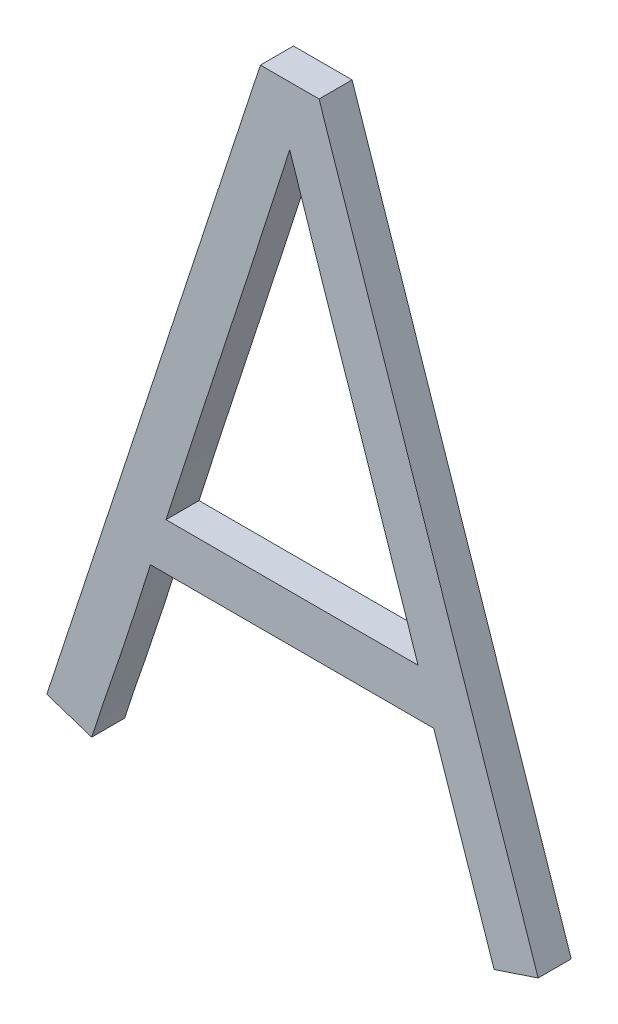
ISO-10303-21;
HEADER;
FILE_DESCRIPTION(('STEP AP214'),'2;1');
FILE_NAME('part.step','',(''),(''),'','','');
FILE_SCHEMA(('AUTOMOTIVE_DESIGN { 1 0 10303 214 1 1 1 1 }'));
ENDSEC;
DATA;
#1=APPLICATION_CONTEXT('core data for automotive mechanical design processes');
#2=APPLICATION_PROTOCOL_DEFINITION('international standard','automotive_design',2000,#1);
#3=PRODUCT_CONTEXT('',#1,'mechanical');
#4=PRODUCT('Part','Part','',(#3));
#5=PRODUCT_RELATED_PRODUCT_CATEGORY('part','',(#4));
#6=PRODUCT_DEFINITION_FORMATION('','',#4);
#7=PRODUCT_DEFINITION_CONTEXT('part definition',#1,'design');
#8=PRODUCT_DEFINITION('design','',#6,#7);
#9=PRODUCT_DEFINITION_SHAPE('','',#8);
#10=(LENGTH_UNIT() NAMED_UNIT(*) SI_UNIT(.MILLI.,.METRE.));
#11=(NAMED_UNIT(*) PLANE_ANGLE_UNIT() SI_UNIT($,.RADIAN.));
#12=(NAMED_UNIT(*) SI_UNIT($,.STERADIAN.) SOLID_ANGLE_UNIT());
#13=UNCERTAINTY_MEASURE_WITH_UNIT(LENGTH_MEASURE(1.E-05),#10,'distance_accuracy_value','');
#14=(GEOMETRIC_REPRESENTATION_CONTEXT(3) GLOBAL_UNCERTAINTY_ASSIGNED_CONTEXT((#13)) GLOBAL_UNIT_ASSIGNED_CONTEXT((#10,
#11,#12)) REPRESENTATION_CONTEXT('',''));
#15=CARTESIAN_POINT('',(0.,0.,0.));
#16=DIRECTION('',(0.,0.,1.));
#17=DIRECTION('',(1.,0.,0.));
#18=AXIS2_PLACEMENT_3D('',#15,#16,#17);
#19=CARTESIAN_POINT('',(63.3244439474191,66.035169325091,-39.1));
#20=DIRECTION('',(0.,9.63997862651713E-12,1.));
#21=DIRECTION('',(0.,-1.,9.63997862651713E-12));
#22=AXIS2_PLACEMENT_3D('',#19,#20,#21);
#23=PLANE('',#22);
#24=DIRECTION('',(1.,0.,0.));
#25=VECTOR('',#24,1.);
#26=CARTESIAN_POINT('',(64.2213908698903,66.4476931722211,-39.1));
#27=LINE('',#26,#25);
#28=CARTESIAN_POINT('',(63.4585614662903,66.4476931722211,-39.099999999999));
#29=VERTEX_POINT('',#28);
#30=CARTESIAN_POINT('',(64.2213908698903,66.4476931722211,-39.099999999999));
#31=VERTEX_POINT('',#30);
#32=EDGE_CURVE('E121',#29,#31,#27,.T.);
#33=ORIENTED_EDGE('',*,*,#32,.T.);
#34=CARTESIAN_POINT('',(64.2213908698903,66.4476931722211,-39.099999999998));
#35=CARTESIAN_POINT('',(64.2108516174786,66.4793164753443,-39.0999999999969));
#36=CARTESIAN_POINT('',(64.2003009751093,66.5109359833296,-39.1000000000004));
#37=CARTESIAN_POINT('',(64.1791809493051,66.5741688182707,-39.1000000000094));
#38=CARTESIAN_POINT('',(64.1686115658287,66.6057821452125,-39.1000000000148));
#39=CARTESIAN_POINT('',(64.1368814150085,66.7006148095122,-39.1000000000226));
#40=CARTESIAN_POINT('',(64.1156986646282,66.7638267783165,-39.1000000000166));
#41=CARTESIAN_POINT('',(64.0732392328759,66.8902192203776,-39.0999999999986));
#42=CARTESIAN_POINT('',(64.0519625516351,66.9533996936783,-39.0999999999867));
#43=CARTESIAN_POINT('',(64.0139639450191,67.0654816477114,-39.0999999999936));
#44=CARTESIAN_POINT('',(63.9972932267702,67.114400504903,-39.1000000000061));
#45=CARTESIAN_POINT('',(63.9639347721806,67.2122322983695,-39.1000000000156));
#46=CARTESIAN_POINT('',(63.9472470359161,67.2611452346699,-39.1000000000126));
#47=CARTESIAN_POINT('',(63.9224651223619,67.3345993274547,-39.1000000000121));
#48=CARTESIAN_POINT('',(63.9142460710539,67.3590982264771,-39.1000000000127));
#49=CARTESIAN_POINT('',(63.8978980794248,67.408126165136,-39.1000000000133));
#50=CARTESIAN_POINT('',(63.8897691395381,67.4326552049172,-39.1000000000135));
#51=CARTESIAN_POINT('',(63.8735647601332,67.4817316759786,-39.1000000000139));
#52=CARTESIAN_POINT('',(63.8654893221128,67.5062791077524,-39.1000000000142));
#53=CARTESIAN_POINT('',(63.8493086235244,67.5553639144615,-39.1000000000147));
#54=CARTESIAN_POINT('',(63.8412033631839,67.5799012894718,-39.1000000000149));
#55=CARTESIAN_POINT('',(63.8330413552903,67.6044199406011,-39.1000000000152));
#56=B_SPLINE_CURVE_WITH_KNOTS('',3,(#34,#35,#36,#37,#38,#39,#40,#41,#42,#43,#44,#45,#46,#47,#48,
#49,#50,#51,#52,#53,#54,#55),.UNSPECIFIED.,.F.,.F.,(4,2,2,2,2,2,2,2,2,2,4),(0.,
0.099999912467656,0.200000047218201,0.400000481257188,0.600000635929237,0.755044814762776,
0.91008830123574,0.987610592252216,1.06513325678089,1.14265808242463,1.22018231804583),.UNSPECIFIED.);
#57=CARTESIAN_POINT('',(63.8330413552903,67.6044199406011,-39.1000000000151));
#58=VERTEX_POINT('',#57);
#59=EDGE_CURVE('E168',#31,#58,#56,.T.);
#60=ORIENTED_EDGE('',*,*,#59,.T.);
#61=CARTESIAN_POINT('',(63.8330413552903,67.6044199406011,-39.1000000000151));
#62=CARTESIAN_POINT('',(63.8278205731385,67.5885910271764,-39.100000000015));
#63=CARTESIAN_POINT('',(63.8226726849173,67.5727385397149,-39.1000000000148));
#64=CARTESIAN_POINT('',(63.8124571177524,67.5410078162966,-39.1000000000145));
#65=CARTESIAN_POINT('',(63.807389438188,67.5251295805401,-39.1000000000143));
#66=CARTESIAN_POINT('',(63.7922081977502,67.4774878884502,-39.100000000014));
#67=CARTESIAN_POINT('',(63.782116464866,67.4457175400197,-39.1000000000141));
#68=CARTESIAN_POINT('',(63.7517099440857,67.3504503953441,-39.1000000000117));
#69=CARTESIAN_POINT('',(63.7312632518136,67.286995639971,-39.1000000000068));
#70=CARTESIAN_POINT('',(63.6901830321792,67.1601470114942,-39.1000000000161));
#71=CARTESIAN_POINT('',(63.6695495051064,67.0967531382964,-39.1000000000304));
#72=CARTESIAN_POINT('',(63.6329239084584,66.9845959165781,-39.1000000000276));
#73=CARTESIAN_POINT('',(63.6169569171012,66.9358243785731,-39.1000000000169));
#74=CARTESIAN_POINT('',(63.5849754369602,66.8382968546229,-39.0999999999995));
#75=CARTESIAN_POINT('',(63.5689609481743,66.7895408686782,-39.0999999999927));
#76=CARTESIAN_POINT('',(63.5371070081971,66.6919715361894,-39.0999999999936));
#77=CARTESIAN_POINT('',(63.5212675573466,66.6431581895337,-39.1000000000013));
#78=CARTESIAN_POINT('',(63.4897734180133,66.5454712830568,-39.1000000000095));
#79=CARTESIAN_POINT('',(63.4741187317694,66.4965977225138,-39.10000000001));
#80=CARTESIAN_POINT('',(63.4585614662903,66.4476931722211,-39.099999999996));
#81=B_SPLINE_CURVE_WITH_KNOTS('',3,(#61,#62,#63,#64,#65,#66,#67,#68,#69,#70,#71,#72,#73,#74,#75,
#76,#77,#78,#79,#80),.UNSPECIFIED.,.F.,.F.,(4,2,2,2,2,2,2,2,2,4),(0.,0.0500022170825777,
0.100004047009198,0.200007998982023,0.400010056723153,0.600011804566333,0.753967838289627,
0.907923878196058,1.06188021787056,1.21583842124076),.UNSPECIFIED.);
#82=EDGE_CURVE('E129',#58,#29,#81,.T.);
#83=ORIENTED_EDGE('',*,*,#82,.T.);
#84=EDGE_LOOP('',(#33,#60,#83));
#85=FACE_BOUND('',#84,.T.);
#86=DIRECTION('',(0.311412180161719,0.950274936030055,0.));
#87=VECTOR('',#86,1.);
#88=CARTESIAN_POINT('',(63.7442757519336,67.7819511472697,-39.1));
#89=LINE('',#88,#87);
#90=CARTESIAN_POINT('',(63.0979512026919,65.8096903982959,-39.1));
#91=VERTEX_POINT('',#90);
#92=CARTESIAN_POINT('',(63.7442757519761,67.7819511472557,-39.1000000000042));
#93=VERTEX_POINT('',#92);
#94=EDGE_CURVE('E110',#91,#93,#89,.T.);
#95=ORIENTED_EDGE('',*,*,#94,.T.);
#96=DIRECTION('',(1.,0.,0.));
#97=VECTOR('',#96,1.);
#98=CARTESIAN_POINT('',(63.9218069585903,67.7819511472511,-39.1));
#99=LINE('',#98,#97);
#100=CARTESIAN_POINT('',(63.9218069585903,67.7819511472511,-39.1000000000042));
#101=VERTEX_POINT('',#100);
#102=EDGE_CURVE('E214',#93,#101,#99,.T.);
#103=ORIENTED_EDGE('',*,*,#102,.T.);
#104=DIRECTION('',(0.318626451465812,-0.947880363983928,0.));
#105=VECTOR('',#104,1.);
#106=CARTESIAN_POINT('',(64.5847750584557,65.8096903982795,-39.1));
#107=LINE('',#106,#105);
#108=CARTESIAN_POINT('',(64.5847750584557,65.8096903982796,-39.0999999999995));
#109=VERTEX_POINT('',#108);
#110=EDGE_CURVE('E220',#101,#109,#107,.T.);
#111=ORIENTED_EDGE('',*,*,#110,.T.);
#112=DIRECTION('',(-0.948683298050467,-0.316227766016979,0.));
#113=VECTOR('',#112,1.);
#114=CARTESIAN_POINT('',(64.4516266534923,65.7653075966251,-39.1));
#115=LINE('',#114,#113);
#116=CARTESIAN_POINT('',(64.4516266534908,65.7653075966296,-39.0999999999994));
#117=VERTEX_POINT('',#116);
#118=EDGE_CURVE('E226',#109,#117,#115,.T.);
#119=ORIENTED_EDGE('',*,*,#118,.T.);
#120=DIRECTION('',(-0.320596174316895,0.947215969572605,0.));
#121=VECTOR('',#120,1.);
#122=CARTESIAN_POINT('',(64.2685475966226,66.3062229919221,-39.1));
#123=LINE('',#122,#121);
#124=CARTESIAN_POINT('',(64.2685475966172,66.3062229919184,-39.1));
#125=VERTEX_POINT('',#124);
#126=EDGE_CURVE('E136',#117,#125,#123,.T.);
#127=ORIENTED_EDGE('',*,*,#126,.T.);
#128=DIRECTION('',(1.,0.,0.));
#129=VECTOR('',#128,1.);
#130=CARTESIAN_POINT('',(63.4114047394903,66.3062229919111,-39.1));
#131=LINE('',#130,#129);
#132=CARTESIAN_POINT('',(63.4114047394903,66.3062229919111,-39.0999999999993));
#133=VERTEX_POINT('',#132);
#134=EDGE_CURVE('E97',#125,#133,#131,.F.);
#135=ORIENTED_EDGE('',*,*,#134,.T.);
#136=CARTESIAN_POINT('',(63.4114047394903,66.3062229919111,-39.0999999999987));
#137=CARTESIAN_POINT('',(63.4015553913232,66.2743755498937,-39.1000000000022));
#138=CARTESIAN_POINT('',(63.3916029509865,66.2425596810493,-39.1000000000024));
#139=CARTESIAN_POINT('',(63.3714608418643,66.1790062694262,-39.100000000001));
#140=CARTESIAN_POINT('',(63.3612711941593,66.1472687199624,-39.0999999999993));
#141=CARTESIAN_POINT('',(63.3414138721604,66.0863126232057,-39.0999999999991));
#142=CARTESIAN_POINT('',(63.3317661149436,66.0570875947001,-39.1000000000003));
#143=CARTESIAN_POINT('',(63.3171446191014,66.0132998822177,-39.0999999999998));
#144=CARTESIAN_POINT('',(63.3122457363777,65.9987120661247,-39.0999999999992));
#145=CARTESIAN_POINT('',(63.3024052825693,65.96955064212,-39.0999999999998));
#146=CARTESIAN_POINT('',(63.2974637115348,65.9549770341915,-39.1000000000011));
#147=CARTESIAN_POINT('',(63.2874400989424,65.9258772389223,-39.1000000000008));
#148=CARTESIAN_POINT('',(63.2823580475636,65.9113510549766,-39.0999999999993));
#149=CARTESIAN_POINT('',(63.272223962651,65.8822884698045,-39.0999999999981));
#150=CARTESIAN_POINT('',(63.2671719280633,65.867752068957,-39.0999999999984));
#151=CARTESIAN_POINT('',(63.2573104026218,65.8385986642462,-39.0999999999981));
#152=CARTESIAN_POINT('',(63.252500886413,65.823981668987,-39.0999999999975));
#153=CARTESIAN_POINT('',(63.2430644871906,65.7946850751376,-39.0999999999981));
#154=CARTESIAN_POINT('',(63.2384376455426,65.7800054631928,-39.0999999999993));
#155=CARTESIAN_POINT('',(63.2338735327903,65.7653075966311,-39.1000000000026));
#156=B_SPLINE_CURVE_WITH_KNOTS('',3,(#136,#137,#138,#139,#140,#141,#142,#143,#144,#145,#146,
#147,#148,#149,#150,#151,#152,#153,#154,#155),.UNSPECIFIED.,.F.,.F.,(4,2,2,2,2,2,2,2,2,4),(0.,
0.100007393144787,0.200005932407737,0.292333828696262,0.338499152530509,0.384664422056366,
0.430832927139567,0.476999801604948,0.523161839305254,0.569334270857004),.UNSPECIFIED.);
#157=CARTESIAN_POINT('',(63.2338735327903,65.7653075966311,-39.1000000000006));
#158=VERTEX_POINT('',#157);
#159=EDGE_CURVE('E24',#133,#158,#156,.T.);
#160=ORIENTED_EDGE('',*,*,#159,.T.);
#161=DIRECTION('',(-0.950605456490971,0.310401781711369,0.));
#162=VECTOR('',#161,1.);
#163=CARTESIAN_POINT('',(63.0979512026919,65.8096903982959,-39.1));
#164=LINE('',#163,#162);
#165=EDGE_CURVE('E85',#158,#91,#164,.T.);
#166=ORIENTED_EDGE('',*,*,#165,.T.);
#167=EDGE_LOOP('',(#95,#103,#111,#119,#127,#135,#160,#166));
#168=FACE_BOUND('',#167,.T.);
#169=ADVANCED_FACE('F17',(#85,#168),#23,.F.);
#170=CARTESIAN_POINT('',(63.0979512026919,65.8096903982959,-39.));
#171=DIRECTION('',(0.310401781711369,0.950605456490971,0.));
#172=DIRECTION('',(-0.950605456490971,0.310401781711369,0.));
#173=AXIS2_PLACEMENT_3D('',#170,#171,#172);
#174=PLANE('',#173);
#175=DIRECTION('',(0.,0.,1.));
#176=VECTOR('',#175,1.);
#177=CARTESIAN_POINT('',(63.2338735327903,65.7653075966311,-39.05));
#178=LINE('',#177,#176);
#179=CARTESIAN_POINT('',(63.2338735327903,65.7653075966311,-38.9999999999993));
#180=VERTEX_POINT('',#179);
#181=EDGE_CURVE('E88',#158,#180,#178,.T.);
#182=ORIENTED_EDGE('',*,*,#181,.T.);
#183=DIRECTION('',(0.95060545649095,-0.310401781711434,3.00878689279397E-12));
#184=VECTOR('',#183,1.);
#185=CARTESIAN_POINT('',(63.0979512026919,65.8096903982959,-38.9999999999978));
#186=LINE('',#185,#184);
#187=CARTESIAN_POINT('',(63.0979512026919,65.8096903982959,-38.9999999999978));
#188=VERTEX_POINT('',#187);
#189=EDGE_CURVE('E123',#188,#180,#186,.T.);
#190=ORIENTED_EDGE('',*,*,#189,.F.);
#191=DIRECTION('',(0.,0.,1.));
#192=VECTOR('',#191,1.);
#193=CARTESIAN_POINT('',(63.0979512026919,65.8096903982959,-39.));
#194=LINE('',#193,#192);
#195=EDGE_CURVE('E91',#188,#91,#194,.F.);
#196=ORIENTED_EDGE('',*,*,#195,.T.);
#197=ORIENTED_EDGE('',*,*,#165,.F.);
#198=EDGE_LOOP('',(#182,#190,#196,#197));
#199=FACE_BOUND('',#198,.T.);
#200=ADVANCED_FACE('F86',(#199),#174,.F.);
#201=CARTESIAN_POINT('',(63.2338735327903,65.7653075966311,-39.));
#202=CARTESIAN_POINT('',(63.2338735327903,65.7653075966311,-39.1));
#203=CARTESIAN_POINT('',(63.2390076233903,65.7818808776511,-39.));
#204=CARTESIAN_POINT('',(63.2390076233903,65.7818808776511,-39.1));
#205=CARTESIAN_POINT('',(63.2498254780903,65.8160820286211,-39.));
#206=CARTESIAN_POINT('',(63.2498254780903,65.8160820286211,-39.1));
#207=CARTESIAN_POINT('',(63.2673700837903,65.8688013646211,-39.));
#208=CARTESIAN_POINT('',(63.2673700837903,65.8688013646211,-39.1));
#209=CARTESIAN_POINT('',(63.2860970132903,65.9217129883511,-39.));
#210=CARTESIAN_POINT('',(63.2860970132903,65.9217129883511,-39.1));
#211=CARTESIAN_POINT('',(63.3046497146903,65.9760772357511,-39.));
#212=CARTESIAN_POINT('',(63.3046497146903,65.9760772357511,-39.1));
#213=CARTESIAN_POINT('',(63.3235981478903,66.0324833115611,-39.));
#214=CARTESIAN_POINT('',(63.3235981478903,66.0324833115611,-39.1));
#215=CARTESIAN_POINT('',(63.3440276705903,66.0942177760611,-39.));
#216=CARTESIAN_POINT('',(63.3440276705903,66.0942177760611,-39.1));
#217=CARTESIAN_POINT('',(63.3656944088903,66.1608828712111,-39.));
#218=CARTESIAN_POINT('',(63.3656944088903,66.1608828712111,-39.1));
#219=CARTESIAN_POINT('',(63.3883327100903,66.2320864682411,-39.));
#220=CARTESIAN_POINT('',(63.3883327100903,66.2320864682411,-39.1));
#221=CARTESIAN_POINT('',(63.4036030780903,66.2810343335811,-39.));
#222=CARTESIAN_POINT('',(63.4036030780903,66.2810343335811,-39.1));
#223=CARTESIAN_POINT('',(63.4114047394903,66.3062229919111,-39.));
#224=CARTESIAN_POINT('',(63.4114047394903,66.3062229919111,-39.1));
#225=B_SPLINE_SURFACE_WITH_KNOTS('',3,1,((#201,#202),(#203,#204),(#205,#206),(#207,#208),(#209,
#210),(#211,#212),(#213,#214),(#215,#216),(#217,#218),(#219,#220),(#221,#222),(#223,#224)),
.UNSPECIFIED.,.F.,.F.,.F.,(4,1,1,1,1,1,1,1,1,4),(2,2),(0.,0.0914270828581,0.1890068395642,
0.29275856775,0.3871744050524,0.4916877757263,0.6063014793816,0.7298204969688,0.8610519020711,
1.),(1.,1.1),.UNSPECIFIED.);
#226=DIRECTION('',(0.,0.,1.));
#227=VECTOR('',#226,1.);
#228=CARTESIAN_POINT('',(63.4114047394903,66.3062229919111,-39.));
#229=LINE('',#228,#227);
#230=CARTESIAN_POINT('',(63.4114047394903,66.3062229919111,-39.0000000000026));
#231=VERTEX_POINT('',#230);
#232=EDGE_CURVE('E99',#133,#231,#229,.T.);
#233=CARTESIAN_POINT('',(63.2338735327903,65.7653075966311,-39.0000000000013));
#234=CARTESIAN_POINT('',(63.2388173735855,65.7812307323006,-38.9999999999989));
#235=CARTESIAN_POINT('',(63.2438372687456,65.7971318409421,-38.9999999999981));
#236=CARTESIAN_POINT('',(63.2540944696768,65.8288598670642,-38.9999999999977));
#237=CARTESIAN_POINT('',(63.2593317289056,65.844686799628,-38.9999999999981));
#238=CARTESIAN_POINT('',(63.2700915776101,65.8762448092172,-38.9999999999985));
#239=CARTESIAN_POINT('',(63.2756141971515,65.8919758759461,-38.9999999999984));
#240=CARTESIAN_POINT('',(63.286591443107,65.9234618589669,-38.9999999999991));
#241=CARTESIAN_POINT('',(63.292046067727,65.9392167758759,-38.9999999999999));
#242=CARTESIAN_POINT('',(63.3024144800101,65.9695507503083,-39.0000000000001));
#243=CARTESIAN_POINT('',(63.3073375012369,65.984126644201,-38.9999999999997));
#244=CARTESIAN_POINT('',(63.3171412220428,66.01329264354,-38.9999999999996));
#245=CARTESIAN_POINT('',(63.3220219213492,66.0278827490772,-38.9999999999999));
#246=CARTESIAN_POINT('',(63.3365889059155,66.0716771457789,-39.0000000000003));
#247=CARTESIAN_POINT('',(63.3462003905806,66.1009064362849,-38.9999999999998));
#248=CARTESIAN_POINT('',(63.3651902151827,66.1594469005944,-39.0000000000002));
#249=CARTESIAN_POINT('',(63.3745685090006,66.1887580893401,-39.0000000000013));
#250=CARTESIAN_POINT('',(63.3931266457987,66.2474455383943,-39.0000000000022));
#251=CARTESIAN_POINT('',(63.4023064747632,66.276821803138,-39.0000000000021));
#252=CARTESIAN_POINT('',(63.4114047394903,66.3062229919111,-39.));
#253=B_SPLINE_CURVE_WITH_KNOTS('',3,(#233,#234,#235,#236,#237,#238,#239,#240,#241,#242,#243,
#244,#245,#246,#247,#248,#249,#250,#251,#252),.UNSPECIFIED.,.F.,.F.,(4,2,2,2,2,2,2,2,2,4),(0.,
0.0500212573007998,0.100031858692739,0.150047740013242,0.200064938362839,0.24621909070013,
0.292373540041359,0.384679525765221,0.477003624286526,0.569334221684642),.UNSPECIFIED.);
#254=EDGE_CURVE('E102',#180,#231,#253,.T.);
#255=ORIENTED_EDGE('',*,*,#232,.T.);
#256=ORIENTED_EDGE('',*,*,#254,.F.);
#257=ORIENTED_EDGE('',*,*,#181,.F.);
#258=ORIENTED_EDGE('',*,*,#159,.F.);
#259=EDGE_LOOP('',(#255,#256,#257,#258));
#260=FACE_BOUND('',#259,.T.);
#261=ADVANCED_FACE('F100',(#260),#225,.F.);
#262=CARTESIAN_POINT('',(63.4114047394903,66.3062229919111,-39.));
#263=DIRECTION('',(0.,1.,0.));
#264=DIRECTION('',(0.,0.,1.));
#265=AXIS2_PLACEMENT_3D('',#262,#263,#264);
#266=PLANE('',#265);
#267=DIRECTION('',(0.,0.,1.));
#268=VECTOR('',#267,1.);
#269=CARTESIAN_POINT('',(64.2685475966226,66.306222991922,-39.));
#270=LINE('',#269,#268);
#271=CARTESIAN_POINT('',(64.2685475966011,66.3062229919148,-39.0000000000026));
#272=VERTEX_POINT('',#271);
#273=EDGE_CURVE('E133',#125,#272,#270,.T.);
#274=ORIENTED_EDGE('',*,*,#273,.T.);
#275=DIRECTION('',(1.,0.,0.));
#276=VECTOR('',#275,1.);
#277=CARTESIAN_POINT('',(63.3244439474191,66.3062229919111,-39.0000000000026));
#278=LINE('',#277,#276);
#279=EDGE_CURVE('E167',#231,#272,#278,.T.);
#280=ORIENTED_EDGE('',*,*,#279,.F.);
#281=ORIENTED_EDGE('',*,*,#232,.F.);
#282=ORIENTED_EDGE('',*,*,#134,.F.);
#283=EDGE_LOOP('',(#274,#280,#281,#282));
#284=FACE_BOUND('',#283,.T.);
#285=ADVANCED_FACE('F177',(#284),#266,.F.);
#286=CARTESIAN_POINT('',(64.2685475966226,66.3062229919221,-39.));
#287=DIRECTION('',(0.947215969572605,0.320596174316895,0.));
#288=DIRECTION('',(-0.320596174316895,0.947215969572605,0.));
#289=AXIS2_PLACEMENT_3D('',#286,#287,#288);
#290=PLANE('',#289);
#291=DIRECTION('',(0.,0.,1.));
#292=VECTOR('',#291,1.);
#293=CARTESIAN_POINT('',(64.4516266534923,65.7653075966251,-39.));
#294=LINE('',#293,#292);
#295=CARTESIAN_POINT('',(64.4516266534908,65.7653075966296,-38.9999999999994));
#296=VERTEX_POINT('',#295);
#297=EDGE_CURVE('E138',#117,#296,#294,.T.);
#298=ORIENTED_EDGE('',*,*,#297,.T.);
#299=DIRECTION('',(0.320596174373443,-0.947215969553466,9.13750771927774E-12));
#300=VECTOR('',#299,1.);
#301=CARTESIAN_POINT('',(64.2685475965903,66.3062229919111,-39.0000000000026));
#302=LINE('',#301,#300);
#303=EDGE_CURVE('E232',#272,#296,#302,.T.);
#304=ORIENTED_EDGE('',*,*,#303,.F.);
#305=ORIENTED_EDGE('',*,*,#273,.F.);
#306=ORIENTED_EDGE('',*,*,#126,.F.);
#307=EDGE_LOOP('',(#298,#304,#305,#306));
#308=FACE_BOUND('',#307,.T.);
#309=ADVANCED_FACE('F247',(#308),#290,.F.);
#310=CARTESIAN_POINT('',(64.4516266534923,65.7653075966251,-39.));
#311=DIRECTION('',(-0.316227766016979,0.948683298050467,0.));
#312=DIRECTION('',(-0.948683298050467,-0.316227766016979,0.));
#313=AXIS2_PLACEMENT_3D('',#310,#311,#312);
#314=PLANE('',#313);
#315=DIRECTION('',(0.,0.,1.));
#316=VECTOR('',#315,1.);
#317=CARTESIAN_POINT('',(64.5847750584557,65.8096903982796,-39.));
#318=LINE('',#317,#316);
#319=CARTESIAN_POINT('',(64.5847750584557,65.8096903982796,-38.9999999999995));
#320=VERTEX_POINT('',#319);
#321=EDGE_CURVE('E223',#109,#320,#318,.T.);
#322=ORIENTED_EDGE('',*,*,#321,.T.);
#323=DIRECTION('',(0.948683298064703,0.31622776597427,-3.06525933100154E-12));
#324=VECTOR('',#323,1.);
#325=CARTESIAN_POINT('',(64.4516266534903,65.7653075966311,-38.9999999999974));
#326=LINE('',#325,#324);
#327=EDGE_CURVE('E235',#296,#320,#326,.T.);
#328=ORIENTED_EDGE('',*,*,#327,.F.);
#329=ORIENTED_EDGE('',*,*,#297,.F.);
#330=ORIENTED_EDGE('',*,*,#118,.F.);
#331=EDGE_LOOP('',(#322,#328,#329,#330));
#332=FACE_BOUND('',#331,.T.);
#333=ADVANCED_FACE('F334',(#332),#314,.F.);
#334=CARTESIAN_POINT('',(64.5847750584557,65.8096903982795,-39.));
#335=DIRECTION('',(-0.947880363983928,-0.318626451465812,0.));
#336=DIRECTION('',(0.318626451465812,-0.947880363983928,0.));
#337=AXIS2_PLACEMENT_3D('',#334,#335,#336);
#338=PLANE('',#337);
#339=DIRECTION('',(0.,0.,-1.));
#340=VECTOR('',#339,1.);
#341=CARTESIAN_POINT('',(63.9218069585903,67.7819511472511,-39.));
#342=LINE('',#341,#340);
#343=CARTESIAN_POINT('',(63.9218069585903,67.7819511472511,-39.0000000000042));
#344=VERTEX_POINT('',#343);
#345=EDGE_CURVE('E217',#101,#344,#342,.F.);
#346=ORIENTED_EDGE('',*,*,#345,.T.);
#347=DIRECTION('',(-0.31862645146584,0.947880363983919,-9.1375550188427E-12));
#348=VECTOR('',#347,1.);
#349=CARTESIAN_POINT('',(64.5847750584557,65.8096903982796,-38.9999999999978));
#350=LINE('',#349,#348);
#351=EDGE_CURVE('E411',#320,#344,#350,.T.);
#352=ORIENTED_EDGE('',*,*,#351,.F.);
#353=ORIENTED_EDGE('',*,*,#321,.F.);
#354=ORIENTED_EDGE('',*,*,#110,.F.);
#355=EDGE_LOOP('',(#346,#352,#353,#354));
#356=FACE_BOUND('',#355,.T.);
#357=ADVANCED_FACE('F323',(#356),#338,.F.);
#358=CARTESIAN_POINT('',(63.9218069585903,67.7819511472511,-39.));
#359=DIRECTION('',(0.,-1.,0.));
#360=DIRECTION('',(0.,0.,-1.));
#361=AXIS2_PLACEMENT_3D('',#358,#359,#360);
#362=PLANE('',#361);
#363=DIRECTION('',(0.,0.,1.));
#364=VECTOR('',#363,1.);
#365=CARTESIAN_POINT('',(63.7442757519336,67.7819511472697,-39.));
#366=LINE('',#365,#364);
#367=CARTESIAN_POINT('',(63.7442757519761,67.7819511472557,-39.0000000000042));
#368=VERTEX_POINT('',#367);
#369=EDGE_CURVE('E111',#93,#368,#366,.T.);
#370=ORIENTED_EDGE('',*,*,#369,.T.);
#371=DIRECTION('',(1.,0.,0.));
#372=VECTOR('',#371,1.);
#373=CARTESIAN_POINT('',(63.3244439474191,67.7819511472511,-39.0000000000168));
#374=LINE('',#373,#372);
#375=EDGE_CURVE('E118',#344,#368,#374,.F.);
#376=ORIENTED_EDGE('',*,*,#375,.F.);
#377=ORIENTED_EDGE('',*,*,#345,.F.);
#378=ORIENTED_EDGE('',*,*,#102,.F.);
#379=EDGE_LOOP('',(#370,#376,#377,#378));
#380=FACE_BOUND('',#379,.T.);
#381=ADVANCED_FACE('F313',(#380),#362,.F.);
#382=CARTESIAN_POINT('',(63.7442757519336,67.7819511472697,-39.));
#383=DIRECTION('',(0.950274936030055,-0.311412180161719,0.));
#384=DIRECTION('',(0.311412180161719,0.950274936030055,0.));
#385=AXIS2_PLACEMENT_3D('',#382,#383,#384);
#386=PLANE('',#385);
#387=ORIENTED_EDGE('',*,*,#195,.F.);
#388=DIRECTION('',(-0.31141218018904,-0.950274936021102,9.16063866382524E-12));
#389=VECTOR('',#388,1.);
#390=CARTESIAN_POINT('',(63.7442757519903,67.7819511472511,-39.0000000000168));
#391=LINE('',#390,#389);
#392=EDGE_CURVE('E114',#368,#188,#391,.T.);
#393=ORIENTED_EDGE('',*,*,#392,.F.);
#394=ORIENTED_EDGE('',*,*,#369,.F.);
#395=ORIENTED_EDGE('',*,*,#94,.F.);
#396=EDGE_LOOP('',(#387,#393,#394,#395));
#397=FACE_BOUND('',#396,.T.);
#398=ADVANCED_FACE('F191',(#397),#386,.F.);
#399=CARTESIAN_POINT('',(63.4585614662903,66.4476931722211,-39.));
#400=CARTESIAN_POINT('',(63.4585614662903,66.4476931722211,-39.1));
#401=CARTESIAN_POINT('',(63.4716012950903,66.4886531314412,-39.));
#402=CARTESIAN_POINT('',(63.4716012950903,66.4886531314412,-39.1));
#403=CARTESIAN_POINT('',(63.4979726079903,66.5710926189011,-39.));
#404=CARTESIAN_POINT('',(63.4979726079903,66.5710926189011,-39.1));
#405=CARTESIAN_POINT('',(63.5381874399903,66.6954599323311,-39.));
#406=CARTESIAN_POINT('',(63.5381874399903,66.6954599323311,-39.1));
#407=CARTESIAN_POINT('',(63.5789576067903,66.8200365933211,-39.));
#408=CARTESIAN_POINT('',(63.5789576067903,66.8200365933211,-39.1));
#409=CARTESIAN_POINT('',(63.6191115104903,66.9423010895611,-39.));
#410=CARTESIAN_POINT('',(63.6191115104903,66.9423010895611,-39.1));
#411=CARTESIAN_POINT('',(63.6574737378903,67.0597340865811,-39.));
#412=CARTESIAN_POINT('',(63.6574737378903,67.0597340865811,-39.1));
#413=CARTESIAN_POINT('',(63.6934986991903,67.1703779908711,-39.));
#414=CARTESIAN_POINT('',(63.6934986991903,67.1703779908711,-39.1));
#415=CARTESIAN_POINT('',(63.7267464246903,67.2730094781511,-39.));
#416=CARTESIAN_POINT('',(63.7267464246903,67.2730094781511,-39.1));
#417=CARTESIAN_POINT('',(63.7568191713903,67.3663915030611,-39.));
#418=CARTESIAN_POINT('',(63.7568191713903,67.3663915030611,-39.1));
#419=CARTESIAN_POINT('',(63.7829857342903,67.4484544575811,-39.));
#420=CARTESIAN_POINT('',(63.7829857342903,67.4484544575811,-39.1));
#421=CARTESIAN_POINT('',(63.8045196518903,67.5161881636511,-39.));
#422=CARTESIAN_POINT('',(63.8045196518903,67.5161881636511,-39.1));
#423=CARTESIAN_POINT('',(63.8206560816903,67.5665960158411,-39.));
#424=CARTESIAN_POINT('',(63.8206560816903,67.5665960158411,-39.1));
#425=CARTESIAN_POINT('',(63.8295689560903,67.5938992668011,-39.));
#426=CARTESIAN_POINT('',(63.8295689560903,67.5938992668011,-39.1));
#427=CARTESIAN_POINT('',(63.8330413552903,67.6044199406011,-39.));
#428=CARTESIAN_POINT('',(63.8330413552903,67.6044199406011,-39.1));
#429=B_SPLINE_SURFACE_WITH_KNOTS('',3,1,((#399,#400),(#401,#402),(#403,#404),(#405,#406),(#407,
#408),(#409,#410),(#411,#412),(#413,#414),(#415,#416),(#417,#418),(#419,#420),(#421,#422),(#423,
#424),(#425,#426),(#427,#428)),.UNSPECIFIED.,.F.,.F.,.F.,(4,1,1,1,1,1,1,1,1,1,1,1,4),(2,2),(0.,
0.106063965778,0.21356742167,0.3225114027777,0.4294907613932,0.5310996803721,0.6273382833862,
0.7166035048674,0.7972923817131,0.8694052746322,0.92913240554194,0.97266380217256,1.),(1.,1.1),.UNSPECIFIED.);
#430=DIRECTION('',(0.,0.,1.));
#431=VECTOR('',#430,1.);
#432=CARTESIAN_POINT('',(63.8330413552903,67.6044199406011,-39.05));
#433=LINE('',#432,#431);
#434=CARTESIAN_POINT('',(63.8330413552903,67.6044199406011,-39.0000000000151));
#435=VERTEX_POINT('',#434);
#436=EDGE_CURVE('E203',#58,#435,#433,.T.);
#437=CARTESIAN_POINT('',(63.4585614662903,66.4476931722211,-38.999999999998));
#438=CARTESIAN_POINT('',(63.4686741965669,66.4794557234006,-38.9999999999985));
#439=CARTESIAN_POINT('',(63.4788198778659,66.5112078102885,-39.0000000000017));
#440=CARTESIAN_POINT('',(63.4991861094591,66.5746876784739,-39.0000000000081));
#441=CARTESIAN_POINT('',(63.5094066591507,66.6064154599649,-39.0000000000113));
#442=CARTESIAN_POINT('',(63.5299317829639,66.6698439320415,-39.000000000012));
#443=CARTESIAN_POINT('',(63.5402363572997,66.7015446225579,-39.0000000000095));
#444=CARTESIAN_POINT('',(63.5609196982166,66.7649218511342,-39.0000000000039));
#445=CARTESIAN_POINT('',(63.571298465002,66.7965983891275,-39.0000000000007));
#446=CARTESIAN_POINT('',(63.6028603226655,66.8928764807751,-38.9999999999985));
#447=CARTESIAN_POINT('',(63.6240588995803,66.9574729611363,-39.0000000000071));
#448=CARTESIAN_POINT('',(63.6557275140435,67.0544098645803,-39.0000000000107));
#449=CARTESIAN_POINT('',(63.6662621642008,67.0867291565337,-39.0000000000104));
#450=CARTESIAN_POINT('',(63.6873003089176,67.1513778499658,-39.0000000000105));
#451=CARTESIAN_POINT('',(63.6978038034974,67.1837072514379,-39.000000000011));
#452=CARTESIAN_POINT('',(63.7187652240189,67.2483813449029,-39.0000000000118));
#453=CARTESIAN_POINT('',(63.7292231493087,67.2807260371072,-39.000000000012));
#454=CARTESIAN_POINT('',(63.750061440957,67.3454404756875,-39.0000000000126));
#455=CARTESIAN_POINT('',(63.7604418072338,67.3778102220897,-39.0000000000129));
#456=CARTESIAN_POINT('',(63.7811155478692,67.4425777856223,-39.0000000000136));
#457=CARTESIAN_POINT('',(63.7914089212808,67.4749756030541,-39.0000000000139));
#458=CARTESIAN_POINT('',(63.8068883592329,67.5235598783852,-39.0000000000144));
#459=CARTESIAN_POINT('',(63.8120547283581,67.5397525414117,-39.0000000000145));
#460=CARTESIAN_POINT('',(63.822469404776,67.5721115682844,-39.0000000000148));
#461=CARTESIAN_POINT('',(63.8277177126948,67.5882779319284,-39.000000000015));
#462=CARTESIAN_POINT('',(63.8330413552903,67.6044199406011,-39.0000000000151));
#463=B_SPLINE_CURVE_WITH_KNOTS('',3,(#437,#438,#439,#440,#441,#442,#443,#444,#445,#446,#447,
#448,#449,#450,#451,#452,#453,#454,#455,#456,#457,#458,#459,#460,#461,#462),.UNSPECIFIED.,.F.,
.F.,(4,2,2,2,2,2,2,2,2,2,2,2,4),(0.,0.100000734517842,0.200000665102285,0.300000850762982,
0.400001311910251,0.603958991235753,0.705937580664636,0.807916103275608,0.909896079966544,
1.0118761640192,1.11385735676834,1.16484782536452,1.2158386837936),.UNSPECIFIED.);
#464=CARTESIAN_POINT('',(63.4585614662903,66.4476931722211,-39.000000000001));
#465=VERTEX_POINT('',#464);
#466=EDGE_CURVE('E117',#465,#435,#463,.T.);
#467=DIRECTION('',(0.,0.,-1.));
#468=VECTOR('',#467,1.);
#469=CARTESIAN_POINT('',(63.4585614662903,66.4476931722211,-39.));
#470=LINE('',#469,#468);
#471=EDGE_CURVE('E124',#465,#29,#470,.T.);
#472=ORIENTED_EDGE('',*,*,#436,.T.);
#473=ORIENTED_EDGE('',*,*,#466,.F.);
#474=ORIENTED_EDGE('',*,*,#471,.T.);
#475=ORIENTED_EDGE('',*,*,#82,.F.);
#476=EDGE_LOOP('',(#472,#473,#474,#475));
#477=FACE_BOUND('',#476,.T.);
#478=ADVANCED_FACE('F180',(#477),#429,.F.);
#479=CARTESIAN_POINT('',(63.8330413552903,67.6044199406011,-39.));
#480=CARTESIAN_POINT('',(63.8330413552903,67.6044199406011,-39.1));
#481=CARTESIAN_POINT('',(63.8365411204903,67.5938915115211,-39.));
#482=CARTESIAN_POINT('',(63.8365411204903,67.5938915115211,-39.1));
#483=CARTESIAN_POINT('',(63.8456023030903,67.5665699087111,-39.));
#484=CARTESIAN_POINT('',(63.8456023030903,67.5665699087111,-39.1));
#485=CARTESIAN_POINT('',(63.8622391346903,67.5161746820511,-39.));
#486=CARTESIAN_POINT('',(63.8622391346903,67.5161746820511,-39.1));
#487=CARTESIAN_POINT('',(63.8845235930903,67.4484332406011,-39.));
#488=CARTESIAN_POINT('',(63.8845235930903,67.4484332406011,-39.1));
#489=CARTESIAN_POINT('',(63.9117569310903,67.3663648610011,-39.));
#490=CARTESIAN_POINT('',(63.9117569310903,67.3663648610011,-39.1));
#491=CARTESIAN_POINT('',(63.9432150266903,67.2729820489211,-39.));
#492=CARTESIAN_POINT('',(63.9432150266903,67.2729820489211,-39.1));
#493=CARTESIAN_POINT('',(63.9781941823903,67.1703979702111,-39.));
#494=CARTESIAN_POINT('',(63.9781941823903,67.1703979702111,-39.1));
#495=CARTESIAN_POINT('',(64.0159337093903,67.0597959042511,-39.));
#496=CARTESIAN_POINT('',(64.0159337093903,67.0597959042511,-39.1));
#497=CARTESIAN_POINT('',(64.0556742191903,66.9423596710411,-39.));
#498=CARTESIAN_POINT('',(64.0556742191903,66.9423596710411,-39.1));
#499=CARTESIAN_POINT('',(64.0968416965903,66.8200397460311,-39.));
#500=CARTESIAN_POINT('',(64.0968416965903,66.8200397460311,-39.1));
#501=CARTESIAN_POINT('',(64.1386266876903,66.6954086844211,-39.));
#502=CARTESIAN_POINT('',(64.1386266876903,66.6954086844211,-39.1));
#503=CARTESIAN_POINT('',(64.1802385804903,66.5710453509711,-39.));
#504=CARTESIAN_POINT('',(64.1802385804903,66.5710453509711,-39.1));
#505=CARTESIAN_POINT('',(64.2077436822903,66.4886399148611,-39.));
#506=CARTESIAN_POINT('',(64.2077436822903,66.4886399148611,-39.1));
#507=CARTESIAN_POINT('',(64.2213908698903,66.4476931722211,-39.));
#508=CARTESIAN_POINT('',(64.2213908698903,66.4476931722211,-39.1));
#509=B_SPLINE_SURFACE_WITH_KNOTS('',3,1,((#479,#480),(#481,#482),(#483,#484),(#485,#486),(#487,
#488),(#489,#490),(#491,#492),(#493,#494),(#495,#496),(#497,#498),(#499,#500),(#501,#502),(#503,
#504),(#505,#506),(#507,#508)),.UNSPECIFIED.,.F.,.F.,.F.,(4,1,1,1,1,1,1,1,1,1,1,1,4),(2,2),(0.,
0.027278384139,0.0707721487181,0.1304813268386,0.2026112524022,0.2833683189372,0.3727536084708,
0.4690886591486,0.570694672169,0.6775719839012,0.7864060135283,0.8938819998456,1.),(1.,1.1),.UNSPECIFIED.);
#510=DIRECTION('',(0.,0.,-1.));
#511=VECTOR('',#510,1.);
#512=CARTESIAN_POINT('',(64.2213908698903,66.4476931722211,-39.));
#513=LINE('',#512,#511);
#514=CARTESIAN_POINT('',(64.2213908698903,66.4476931722211,-39.000000000004));
#515=VERTEX_POINT('',#514);
#516=EDGE_CURVE('E45',#31,#515,#513,.F.);
#517=CARTESIAN_POINT('',(63.8330413552903,67.6044199406011,-39.0000000000151));
#518=CARTESIAN_POINT('',(63.8435646239686,67.5727908818068,-39.0000000000148));
#519=CARTESIAN_POINT('',(63.8540029655804,67.5411337210613,-39.0000000000145));
#520=CARTESIAN_POINT('',(63.8748670747748,67.4778158415031,-39.0000000000139));
#521=CARTESIAN_POINT('',(63.8852928425682,67.4461551227601,-39.0000000000136));
#522=CARTESIAN_POINT('',(63.9062896658747,67.3828809872593,-39.0000000000129));
#523=CARTESIAN_POINT('',(63.9168607246287,67.3512675715742,-39.0000000000125));
#524=CARTESIAN_POINT('',(63.9381435291823,67.2880880649722,-39.0000000000122));
#525=CARTESIAN_POINT('',(63.9488552756332,67.2565219742753,-39.0000000000123));
#526=CARTESIAN_POINT('',(63.9703395779264,67.1934103715079,-39.0000000000106));
#527=CARTESIAN_POINT('',(63.9811121340942,67.1618648595485,-39.0000000000087));
#528=CARTESIAN_POINT('',(64.0026272316794,67.0987636845614,-39.0000000000124));
#529=CARTESIAN_POINT('',(64.0133697731874,67.0672080215647,-39.0000000000179));
#530=CARTESIAN_POINT('',(64.0406865748043,66.9867013044205,-39.0000000000214));
#531=CARTESIAN_POINT('',(64.0572163200475,66.9377351470164,-39.0000000000136));
#532=CARTESIAN_POINT('',(64.0901959785562,66.8397758086646,-39.0000000000028));
#533=CARTESIAN_POINT('',(64.106645891521,66.7907826276159,-38.9999999999998));
#534=CARTESIAN_POINT('',(64.1395025720733,66.6927813372603,-39.0000000000002));
#535=CARTESIAN_POINT('',(64.1559093392946,66.6437732278306,-39.0000000000037));
#536=CARTESIAN_POINT('',(64.1886810529048,66.5457433662671,-39.0000000000071));
#537=CARTESIAN_POINT('',(64.2050459995527,66.49672161422,-39.000000000007));
#538=CARTESIAN_POINT('',(64.2213908698903,66.4476931722211,-39.));
#539=B_SPLINE_CURVE_WITH_KNOTS('',3,(#517,#518,#519,#520,#521,#522,#523,#524,#525,#526,#527,
#528,#529,#530,#531,#532,#533,#534,#535,#536,#537,#538),.UNSPECIFIED.,.F.,.F.,(4,2,2,2,2,2,2,2,
2,2,4),(0.,0.100001010700319,0.200000321377524,0.300001866303878,0.400003874388364,
0.500006418348935,0.600008659635525,0.755051225870507,0.910094375718601,1.06513883682053,
1.22018233512715),.UNSPECIFIED.);
#540=EDGE_CURVE('E36',#435,#515,#539,.T.);
#541=ORIENTED_EDGE('',*,*,#516,.T.);
#542=ORIENTED_EDGE('',*,*,#540,.F.);
#543=ORIENTED_EDGE('',*,*,#436,.F.);
#544=ORIENTED_EDGE('',*,*,#59,.F.);
#545=EDGE_LOOP('',(#541,#542,#543,#544));
#546=FACE_BOUND('',#545,.T.);
#547=ADVANCED_FACE('F19',(#546),#509,.F.);
#548=CARTESIAN_POINT('',(64.2213908698903,66.4476931722211,-39.));
#549=DIRECTION('',(0.,-1.,0.));
#550=DIRECTION('',(0.,0.,-1.));
#551=AXIS2_PLACEMENT_3D('',#548,#549,#550);
#552=PLANE('',#551);
#553=ORIENTED_EDGE('',*,*,#471,.F.);
#554=DIRECTION('',(1.,0.,0.));
#555=VECTOR('',#554,1.);
#556=CARTESIAN_POINT('',(63.3244439474191,66.4476931722211,-39.000000000004));
#557=LINE('',#556,#555);
#558=EDGE_CURVE('E11',#515,#465,#557,.F.);
#559=ORIENTED_EDGE('',*,*,#558,.F.);
#560=ORIENTED_EDGE('',*,*,#516,.F.);
#561=ORIENTED_EDGE('',*,*,#32,.F.);
#562=EDGE_LOOP('',(#553,#559,#560,#561));
#563=FACE_BOUND('',#562,.T.);
#564=ADVANCED_FACE('F157',(#563),#552,.F.);
#565=CARTESIAN_POINT('',(63.3244439474191,66.035169325091,-39.));
#566=DIRECTION('',(0.,9.63997862651713E-12,1.));
#567=DIRECTION('',(0.,-1.,9.63997862651713E-12));
#568=AXIS2_PLACEMENT_3D('',#565,#566,#567);
#569=PLANE('',#568);
#570=ORIENTED_EDGE('',*,*,#540,.T.);
#571=ORIENTED_EDGE('',*,*,#558,.T.);
#572=ORIENTED_EDGE('',*,*,#466,.T.);
#573=EDGE_LOOP('',(#570,#571,#572));
#574=FACE_BOUND('',#573,.T.);
#575=ORIENTED_EDGE('',*,*,#375,.T.);
#576=ORIENTED_EDGE('',*,*,#392,.T.);
#577=ORIENTED_EDGE('',*,*,#189,.T.);
#578=ORIENTED_EDGE('',*,*,#254,.T.);
#579=ORIENTED_EDGE('',*,*,#279,.T.);
#580=ORIENTED_EDGE('',*,*,#303,.T.);
#581=ORIENTED_EDGE('',*,*,#327,.T.);
#582=ORIENTED_EDGE('',*,*,#351,.T.);
#583=EDGE_LOOP('',(#575,#576,#577,#578,#579,#580,#581,#582));
#584=FACE_BOUND('',#583,.T.);
#585=ADVANCED_FACE('F153',(#574,#584),#569,.T.);
#586=CLOSED_SHELL('',(#169,#200,#261,#285,#309,#333,#357,#381,#398,#478,#547,#564,#585));
#587=MANIFOLD_SOLID_BREP('B1',#586);
#588=ADVANCED_BREP_SHAPE_REPRESENTATION('',(#18,#587),#14);
#589=SHAPE_DEFINITION_REPRESENTATION(#9,#588);
ENDSEC;
END-ISO-10303-21;
